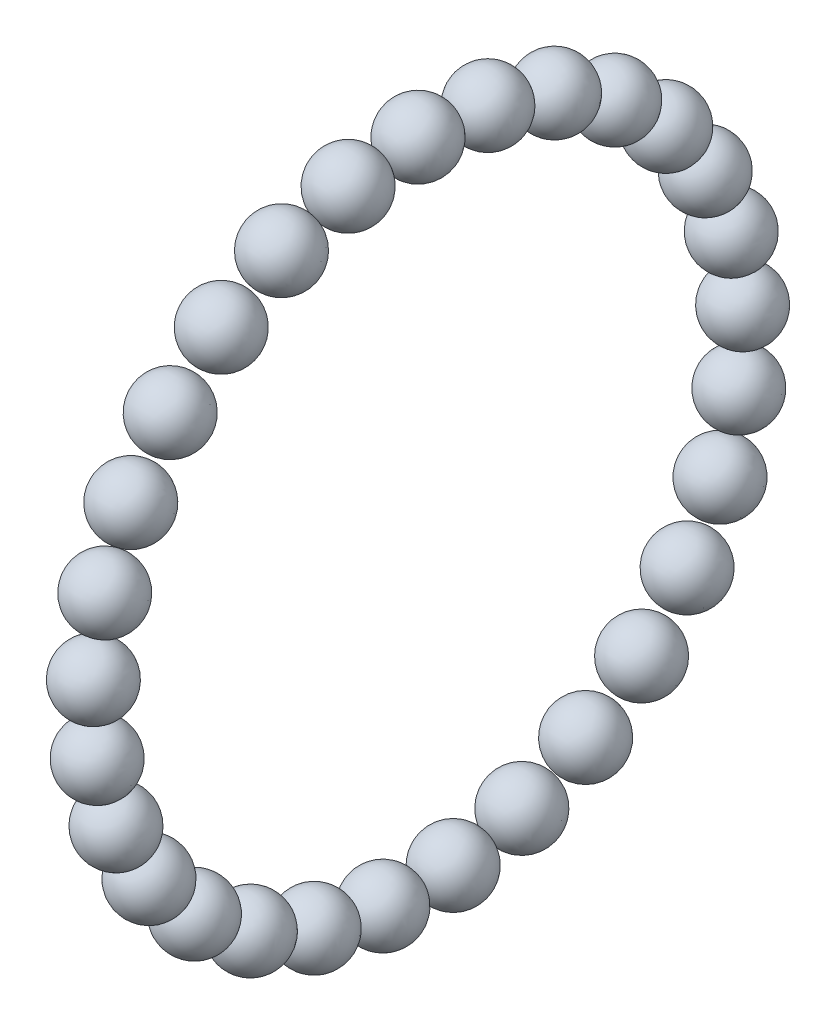
ISO-10303-21;
HEADER;
FILE_DESCRIPTION(('STEP AP214'),'2;1');
FILE_NAME('part.step','',(''),(''),'','','');
FILE_SCHEMA(('AUTOMOTIVE_DESIGN { 1 0 10303 214 1 1 1 1 }'));
ENDSEC;
DATA;
#1=APPLICATION_CONTEXT('core data for automotive mechanical design processes');
#2=APPLICATION_PROTOCOL_DEFINITION('international standard','automotive_design',2000,#1);
#3=PRODUCT_CONTEXT('',#1,'mechanical');
#4=PRODUCT('Part','Part','',(#3));
#5=PRODUCT_RELATED_PRODUCT_CATEGORY('part','',(#4));
#6=PRODUCT_DEFINITION_FORMATION('','',#4);
#7=PRODUCT_DEFINITION_CONTEXT('part definition',#1,'design');
#8=PRODUCT_DEFINITION('design','',#6,#7);
#9=PRODUCT_DEFINITION_SHAPE('','',#8);
#10=(LENGTH_UNIT() NAMED_UNIT(*) SI_UNIT(.MILLI.,.METRE.));
#11=(NAMED_UNIT(*) PLANE_ANGLE_UNIT() SI_UNIT($,.RADIAN.));
#12=(NAMED_UNIT(*) SI_UNIT($,.STERADIAN.) SOLID_ANGLE_UNIT());
#13=UNCERTAINTY_MEASURE_WITH_UNIT(LENGTH_MEASURE(1.E-05),#10,'distance_accuracy_value','');
#14=(GEOMETRIC_REPRESENTATION_CONTEXT(3) GLOBAL_UNCERTAINTY_ASSIGNED_CONTEXT((#13)) GLOBAL_UNIT_ASSIGNED_CONTEXT((#10,
#11,#12)) REPRESENTATION_CONTEXT('',''));
#15=CARTESIAN_POINT('',(0.,0.,0.));
#16=DIRECTION('',(0.,0.,1.));
#17=DIRECTION('',(1.,0.,0.));
#18=AXIS2_PLACEMENT_3D('',#15,#16,#17);
#19=CARTESIAN_POINT('',(0.,18.6052961032546,-8.60772658198543));
#20=DIRECTION('',(0.,0.419889101560265,0.907575419670957));
#21=DIRECTION('',(1.,0.,0.));
#22=AXIS2_PLACEMENT_3D('',#19,#20,#21);
#23=SPHERICAL_SURFACE('',#22,2.1);
#24=CARTESIAN_POINT('',(0.,19.4870632165312,-6.70181820067642));
#25=VERTEX_POINT('',#24);
#26=VERTEX_LOOP('',#25);
#27=FACE_BOUND('',#26,.T.);
#28=ADVANCED_FACE('F12',(#27),#23,.T.);
#29=CLOSED_SHELL('',(#28));
#30=MANIFOLD_SOLID_BREP('B1',#29);
#31=CARTESIAN_POINT('',(0.,13.2714188380275,-15.6243221301166));
#32=DIRECTION('',(0.,0.762162055127636,0.647386284781828));
#33=DIRECTION('',(1.,0.,0.));
#34=AXIS2_PLACEMENT_3D('',#31,#32,#33);
#35=SPHERICAL_SURFACE('',#34,2.1);
#36=CARTESIAN_POINT('',(0.,14.8719591537955,-14.2648109320747));
#37=VERTEX_POINT('',#36);
#38=VERTEX_LOOP('',#37);
#39=FACE_BOUND('',#38,.T.);
#40=ADVANCED_FACE('F20',(#39),#35,.T.);
#41=CLOSED_SHELL('',(#40));
#42=MANIFOLD_SOLID_BREP('B1',#41);
#43=CARTESIAN_POINT('',(0.,5.48433093984903,-19.7527748466441));
#44=DIRECTION('',(0.,0.963549992519223,0.267528338529221));
#45=DIRECTION('',(1.,0.,0.));
#46=AXIS2_PLACEMENT_3D('',#43,#44,#45);
#47=SPHERICAL_SURFACE('',#46,2.1);
#48=CARTESIAN_POINT('',(0.,7.5077859241394,-19.1909653357327));
#49=VERTEX_POINT('',#48);
#50=VERTEX_LOOP('',#49);
#51=FACE_BOUND('',#50,.T.);
#52=ADVANCED_FACE('F30',(#51),#47,.T.);
#53=CLOSED_SHELL('',(#52));
#54=MANIFOLD_SOLID_BREP('B1',#53);
#55=CARTESIAN_POINT('',(0.,-3.31653092933168,-20.2299437121013));
#56=DIRECTION('',(0.,0.986826522541526,-0.161781996552765));
#57=DIRECTION('',(1.,0.,0.));
#58=AXIS2_PLACEMENT_3D('',#55,#56,#57);
#59=SPHERICAL_SURFACE('',#58,2.1);
#60=CARTESIAN_POINT('',(0.,-1.24419523199448,-20.5696859048621));
#61=VERTEX_POINT('',#60);
#62=VERTEX_LOOP('',#61);
#63=FACE_BOUND('',#62,.T.);
#64=ADVANCED_FACE('F34',(#63),#59,.T.);
#65=CLOSED_SHELL('',(#64));
#66=MANIFOLD_SOLID_BREP('B1',#65);
#67=CARTESIAN_POINT('',(0.,-11.5043348399288,-16.9676244622163));
#68=DIRECTION('',(0.,0.827688998156891,-0.561187065362383));
#69=DIRECTION('',(1.,0.,0.));
#70=AXIS2_PLACEMENT_3D('',#67,#68,#69);
#71=SPHERICAL_SURFACE('',#70,2.1);
#72=CARTESIAN_POINT('',(0.,-9.76618794379937,-18.1461172994773));
#73=VERTEX_POINT('',#72);
#74=VERTEX_LOOP('',#73);
#75=FACE_BOUND('',#74,.T.);
#76=ADVANCED_FACE('F39',(#75),#71,.T.);
#77=CLOSED_SHELL('',(#76));
#78=MANIFOLD_SOLID_BREP('B1',#77);
#79=CARTESIAN_POINT('',(0.,-17.5655721114356,-10.5688540721289));
#80=DIRECTION('',(0.,0.515553857177022,-0.856857176167589));
#81=DIRECTION('',(1.,0.,0.));
#82=AXIS2_PLACEMENT_3D('',#79,#80,#81);
#83=SPHERICAL_SURFACE('',#82,2.1);
#84=CARTESIAN_POINT('',(0.,-16.4829090113639,-12.3682541420809));
#85=VERTEX_POINT('',#84);
#86=VERTEX_LOOP('',#85);
#87=FACE_BOUND('',#86,.T.);
#88=ADVANCED_FACE('F44',(#87),#83,.T.);
#89=CLOSED_SHELL('',(#88));
#90=MANIFOLD_SOLID_BREP('B1',#89);
#91=CARTESIAN_POINT('',(0.,-20.3798281216643,-2.21643987769081));
#92=DIRECTION('',(0.,0.108119018423942,-0.99413795715436));
#93=DIRECTION('',(1.,0.,0.));
#94=AXIS2_PLACEMENT_3D('',#91,#92,#93);
#95=SPHERICAL_SURFACE('',#94,2.1);
#96=CARTESIAN_POINT('',(0.,-20.1527781829741,-4.30412958771496));
#97=VERTEX_POINT('',#96);
#98=VERTEX_LOOP('',#97);
#99=FACE_BOUND('',#98,.T.);
#100=ADVANCED_FACE('F49',(#99),#95,.T.);
#101=CLOSED_SHELL('',(#100));
#102=MANIFOLD_SOLID_BREP('B1',#101);
#103=CARTESIAN_POINT('',(0.,-19.4268900092474,6.54568136778758));
#104=DIRECTION('',(0.,-0.31930153013598,-0.947653171182803));
#105=DIRECTION('',(1.,0.,0.));
#106=AXIS2_PLACEMENT_3D('',#103,#104,#105);
#107=SPHERICAL_SURFACE('',#106,2.1);
#108=CARTESIAN_POINT('',(0.,-20.097423222533,4.55560970830369));
#109=VERTEX_POINT('',#108);
#110=VERTEX_LOOP('',#109);
#111=FACE_BOUND('',#110,.T.);
#112=ADVANCED_FACE('F54',(#111),#107,.T.);
#113=CLOSED_SHELL('',(#112));
#114=MANIFOLD_SOLID_BREP('B1',#113);
#115=CARTESIAN_POINT('',(0.,-14.8829075844242,14.0978389064952));
#116=DIRECTION('',(0.,-0.687699458853423,-0.725995491923131));
#117=DIRECTION('',(1.,0.,0.));
#118=AXIS2_PLACEMENT_3D('',#115,#116,#117);
#119=SPHERICAL_SURFACE('',#118,2.1);
#120=CARTESIAN_POINT('',(0.,-16.3270764480164,12.5732483734566));
#121=VERTEX_POINT('',#120);
#122=VERTEX_LOOP('',#121);
#123=FACE_BOUND('',#122,.T.);
#124=ADVANCED_FACE('F59',(#123),#119,.T.);
#125=CLOSED_SHELL('',(#124));
#126=MANIFOLD_SOLID_BREP('B1',#125);
#127=CARTESIAN_POINT('',(0.,-7.58783218446825,19.0440227562442));
#128=DIRECTION('',(0.,-0.928976719816791,-0.370138155339915));
#129=DIRECTION('',(1.,0.,0.));
#130=AXIS2_PLACEMENT_3D('',#127,#128,#129);
#131=SPHERICAL_SURFACE('',#130,2.1);
#132=CARTESIAN_POINT('',(0.,-9.53868329608351,18.2667326300304));
#133=VERTEX_POINT('',#132);
#134=VERTEX_LOOP('',#133);
#135=FACE_BOUND('',#134,.T.);
#136=ADVANCED_FACE('F64',(#135),#131,.T.);
#137=CLOSED_SHELL('',(#136));
#138=MANIFOLD_SOLID_BREP('B1',#137);
#139=CARTESIAN_POINT('',(0.,1.10984762600106,20.4699349839481));
#140=DIRECTION('',(0.,-0.998533413851124,0.0541389085854176));
#141=DIRECTION('',(1.,0.,0.));
#142=AXIS2_PLACEMENT_3D('',#139,#140,#141);
#143=SPHERICAL_SURFACE('',#142,2.1);
#144=CARTESIAN_POINT('',(0.,-0.9870725430863,20.5836266919774));
#145=VERTEX_POINT('',#144);
#146=VERTEX_LOOP('',#145);
#147=FACE_BOUND('',#146,.T.);
#148=ADVANCED_FACE('F69',(#147),#143,.T.);
#149=CLOSED_SHELL('',(#148));
#150=MANIFOLD_SOLID_BREP('B1',#149);
#151=CARTESIAN_POINT('',(0.,9.6023730343457,18.1119969111435));
#152=DIRECTION('',(0.,-0.883512044446023,0.46840844069979));
#153=DIRECTION('',(1.,0.,0.));
#154=AXIS2_PLACEMENT_3D('',#151,#152,#153);
#155=SPHERICAL_SURFACE('',#154,2.1);
#156=CARTESIAN_POINT('',(0.,7.74699774100905,19.095654636613));
#157=VERTEX_POINT('',#156);
#158=VERTEX_LOOP('',#157);
#159=FACE_BOUND('',#158,.T.);
#160=ADVANCED_FACE('F74',(#159),#155,.T.);
#161=CLOSED_SHELL('',(#160));
#162=MANIFOLD_SOLID_BREP('B1',#161);
#163=CARTESIAN_POINT('',(0.,16.3199078469657,12.4060714114722));
#164=DIRECTION('',(0.,-0.605174215193765,0.796093065705644));
#165=DIRECTION('',(1.,0.,0.));
#166=AXIS2_PLACEMENT_3D('',#163,#164,#165);
#167=SPHERICAL_SURFACE('',#166,2.1);
#168=CARTESIAN_POINT('',(0.,15.0490419950588,14.0778668494541));
#169=VERTEX_POINT('',#168);
#170=VERTEX_LOOP('',#169);
#171=FACE_BOUND('',#170,.T.);
#172=ADVANCED_FACE('F79',(#171),#167,.T.);
#173=CLOSED_SHELL('',(#172));
#174=MANIFOLD_SOLID_BREP('B1',#173);
#175=CARTESIAN_POINT('',(0.,20.0207213920568,4.40689402432599));
#176=DIRECTION('',(0.,-0.214970440211024,0.976620555710087));
#177=DIRECTION('',(1.,0.,0.));
#178=AXIS2_PLACEMENT_3D('',#175,#176,#177);
#179=SPHERICAL_SURFACE('',#178,2.1);
#180=CARTESIAN_POINT('',(0.,19.5692834676136,6.45779719131718));
#181=VERTEX_POINT('',#180);
#182=VERTEX_LOOP('',#181);
#183=FACE_BOUND('',#182,.T.);
#184=ADVANCED_FACE('F84',(#183),#179,.T.);
#185=CLOSED_SHELL('',(#184));
#186=MANIFOLD_SOLID_BREP('B1',#185);
#187=CARTESIAN_POINT('',(0.,0.,0.));
#188=DIRECTION('',(0.,0.,1.));
#189=DIRECTION('',(1.,0.,0.));
#190=AXIS2_PLACEMENT_3D('',#187,#188,#189);
#191=SPHERICAL_SURFACE('',#190,0.005);
#192=CARTESIAN_POINT('',(0.,0.,0.005));
#193=VERTEX_POINT('',#192);
#194=VERTEX_LOOP('',#193);
#195=FACE_BOUND('',#194,.T.);
#196=ADVANCED_FACE('F89',(#195),#191,.T.);
#197=CLOSED_SHELL('',(#196));
#198=MANIFOLD_SOLID_BREP('B1',#197);
#199=CARTESIAN_POINT('',(0.,20.5,0.));
#200=DIRECTION('',(0.,0.,1.));
#201=DIRECTION('',(1.,0.,0.));
#202=AXIS2_PLACEMENT_3D('',#199,#200,#201);
#203=SPHERICAL_SURFACE('',#202,2.1);
#204=CARTESIAN_POINT('',(0.,20.5,2.1));
#205=VERTEX_POINT('',#204);
#206=VERTEX_LOOP('',#205);
#207=FACE_BOUND('',#206,.T.);
#208=ADVANCED_FACE('F94',(#207),#203,.T.);
#209=CLOSED_SHELL('',(#208));
#210=MANIFOLD_SOLID_BREP('B1',#209);
#211=CARTESIAN_POINT('',(0.,18.6052961032546,8.60772658198543));
#212=DIRECTION('',(0.,-0.419889101560264,0.907575419670957));
#213=DIRECTION('',(1.,0.,0.));
#214=AXIS2_PLACEMENT_3D('',#211,#212,#213);
#215=SPHERICAL_SURFACE('',#214,2.1);
#216=CARTESIAN_POINT('',(0.,17.723528989978,10.5136349632944));
#217=VERTEX_POINT('',#216);
#218=VERTEX_LOOP('',#217);
#219=FACE_BOUND('',#218,.T.);
#220=ADVANCED_FACE('F99',(#219),#215,.T.);
#221=CLOSED_SHELL('',(#220));
#222=MANIFOLD_SOLID_BREP('B1',#221);
#223=CARTESIAN_POINT('',(0.,13.2714188380275,15.6243221301166));
#224=DIRECTION('',(0.,-0.762162055127637,0.647386284781828));
#225=DIRECTION('',(1.,0.,0.));
#226=AXIS2_PLACEMENT_3D('',#223,#224,#225);
#227=SPHERICAL_SURFACE('',#226,2.1);
#228=CARTESIAN_POINT('',(0.,11.6708785222594,16.9838333281584));
#229=VERTEX_POINT('',#228);
#230=VERTEX_LOOP('',#229);
#231=FACE_BOUND('',#230,.T.);
#232=ADVANCED_FACE('F104',(#231),#227,.T.);
#233=CLOSED_SHELL('',(#232));
#234=MANIFOLD_SOLID_BREP('B1',#233);
#235=CARTESIAN_POINT('',(0.,5.48433093984903,19.7527748466441));
#236=DIRECTION('',(0.,-0.963549992519223,0.267528338529221));
#237=DIRECTION('',(1.,0.,0.));
#238=AXIS2_PLACEMENT_3D('',#235,#236,#237);
#239=SPHERICAL_SURFACE('',#238,2.1);
#240=CARTESIAN_POINT('',(0.,3.46087595555866,20.3145843575554));
#241=VERTEX_POINT('',#240);
#242=VERTEX_LOOP('',#241);
#243=FACE_BOUND('',#242,.T.);
#244=ADVANCED_FACE('F109',(#243),#239,.T.);
#245=CLOSED_SHELL('',(#244));
#246=MANIFOLD_SOLID_BREP('B1',#245);
#247=CARTESIAN_POINT('',(0.,-3.31653092933168,20.2299437121013));
#248=DIRECTION('',(0.,-0.986826522541526,-0.161781996552764));
#249=DIRECTION('',(1.,0.,0.));
#250=AXIS2_PLACEMENT_3D('',#247,#248,#249);
#251=SPHERICAL_SURFACE('',#250,2.1);
#252=CARTESIAN_POINT('',(0.,-5.38886662666888,19.8902015193405));
#253=VERTEX_POINT('',#252);
#254=VERTEX_LOOP('',#253);
#255=FACE_BOUND('',#254,.T.);
#256=ADVANCED_FACE('F114',(#255),#251,.T.);
#257=CLOSED_SHELL('',(#256));
#258=MANIFOLD_SOLID_BREP('B1',#257);
#259=CARTESIAN_POINT('',(0.,-11.5043348399288,16.9676244622163));
#260=DIRECTION('',(0.,-0.827688998156891,-0.561187065362382));
#261=DIRECTION('',(1.,0.,0.));
#262=AXIS2_PLACEMENT_3D('',#259,#260,#261);
#263=SPHERICAL_SURFACE('',#262,2.1);
#264=CARTESIAN_POINT('',(0.,-13.2424817360583,15.7891316249552));
#265=VERTEX_POINT('',#264);
#266=VERTEX_LOOP('',#265);
#267=FACE_BOUND('',#266,.T.);
#268=ADVANCED_FACE('F119',(#267),#263,.T.);
#269=CLOSED_SHELL('',(#268));
#270=MANIFOLD_SOLID_BREP('B1',#269);
#271=CARTESIAN_POINT('',(0.,-17.5655721114356,10.5688540721289));
#272=DIRECTION('',(0.,-0.515553857177022,-0.856857176167589));
#273=DIRECTION('',(1.,0.,0.));
#274=AXIS2_PLACEMENT_3D('',#271,#272,#273);
#275=SPHERICAL_SURFACE('',#274,2.1);
#276=CARTESIAN_POINT('',(0.,-18.6482352115073,8.769454002177));
#277=VERTEX_POINT('',#276);
#278=VERTEX_LOOP('',#277);
#279=FACE_BOUND('',#278,.T.);
#280=ADVANCED_FACE('F124',(#279),#275,.T.);
#281=CLOSED_SHELL('',(#280));
#282=MANIFOLD_SOLID_BREP('B1',#281);
#283=CARTESIAN_POINT('',(0.,-20.3798281216643,2.21643987769081));
#284=DIRECTION('',(0.,-0.108119018423942,-0.99413795715436));
#285=DIRECTION('',(1.,0.,0.));
#286=AXIS2_PLACEMENT_3D('',#283,#284,#285);
#287=SPHERICAL_SURFACE('',#286,2.1);
#288=CARTESIAN_POINT('',(0.,-20.6068780603546,0.128750167666654));
#289=VERTEX_POINT('',#288);
#290=VERTEX_LOOP('',#289);
#291=FACE_BOUND('',#290,.T.);
#292=ADVANCED_FACE('F129',(#291),#287,.T.);
#293=CLOSED_SHELL('',(#292));
#294=MANIFOLD_SOLID_BREP('B1',#293);
#295=CARTESIAN_POINT('',(0.,-19.4268900092474,-6.54568136778759));
#296=DIRECTION('',(0.,0.31930153013598,-0.947653171182802));
#297=DIRECTION('',(1.,0.,0.));
#298=AXIS2_PLACEMENT_3D('',#295,#296,#297);
#299=SPHERICAL_SURFACE('',#298,2.1);
#300=CARTESIAN_POINT('',(0.,-18.7563567959619,-8.53575302727147));
#301=VERTEX_POINT('',#300);
#302=VERTEX_LOOP('',#301);
#303=FACE_BOUND('',#302,.T.);
#304=ADVANCED_FACE('F134',(#303),#299,.T.);
#305=CLOSED_SHELL('',(#304));
#306=MANIFOLD_SOLID_BREP('B1',#305);
#307=CARTESIAN_POINT('',(0.,-14.8829075844242,-14.0978389064952));
#308=DIRECTION('',(0.,0.687699458853423,-0.725995491923131));
#309=DIRECTION('',(1.,0.,0.));
#310=AXIS2_PLACEMENT_3D('',#307,#308,#309);
#311=SPHERICAL_SURFACE('',#310,2.1);
#312=CARTESIAN_POINT('',(0.,-13.438738720832,-15.6224294395338));
#313=VERTEX_POINT('',#312);
#314=VERTEX_LOOP('',#313);
#315=FACE_BOUND('',#314,.T.);
#316=ADVANCED_FACE('F139',(#315),#311,.T.);
#317=CLOSED_SHELL('',(#316));
#318=MANIFOLD_SOLID_BREP('B1',#317);
#319=CARTESIAN_POINT('',(0.,-7.58783218446825,-19.0440227562442));
#320=DIRECTION('',(0.,0.928976719816791,-0.370138155339915));
#321=DIRECTION('',(1.,0.,0.));
#322=AXIS2_PLACEMENT_3D('',#319,#320,#321);
#323=SPHERICAL_SURFACE('',#322,2.1);
#324=CARTESIAN_POINT('',(0.,-5.63698107285299,-19.821312882458));
#325=VERTEX_POINT('',#324);
#326=VERTEX_LOOP('',#325);
#327=FACE_BOUND('',#326,.T.);
#328=ADVANCED_FACE('F144',(#327),#323,.T.);
#329=CLOSED_SHELL('',(#328));
#330=MANIFOLD_SOLID_BREP('B1',#329);
#331=CARTESIAN_POINT('',(0.,1.10984762600106,-20.4699349839481));
#332=DIRECTION('',(0.,0.998533413851124,0.0541389085854176));
#333=DIRECTION('',(1.,0.,0.));
#334=AXIS2_PLACEMENT_3D('',#331,#332,#333);
#335=SPHERICAL_SURFACE('',#334,2.1);
#336=CARTESIAN_POINT('',(0.,3.20676779508842,-20.3562432759187));
#337=VERTEX_POINT('',#336);
#338=VERTEX_LOOP('',#337);
#339=FACE_BOUND('',#338,.T.);
#340=ADVANCED_FACE('F149',(#339),#335,.T.);
#341=CLOSED_SHELL('',(#340));
#342=MANIFOLD_SOLID_BREP('B1',#341);
#343=CARTESIAN_POINT('',(0.,9.6023730343457,-18.1119969111435));
#344=DIRECTION('',(0.,0.883512044446023,0.46840844069979));
#345=DIRECTION('',(1.,0.,0.));
#346=AXIS2_PLACEMENT_3D('',#343,#344,#345);
#347=SPHERICAL_SURFACE('',#346,2.1);
#348=CARTESIAN_POINT('',(0.,11.4577483276823,-17.1283391856739));
#349=VERTEX_POINT('',#348);
#350=VERTEX_LOOP('',#349);
#351=FACE_BOUND('',#350,.T.);
#352=ADVANCED_FACE('F154',(#351),#347,.T.);
#353=CLOSED_SHELL('',(#352));
#354=MANIFOLD_SOLID_BREP('B1',#353);
#355=CARTESIAN_POINT('',(0.,16.3199078469657,-12.4060714114722));
#356=DIRECTION('',(0.,0.605174215193765,0.796093065705644));
#357=DIRECTION('',(1.,0.,0.));
#358=AXIS2_PLACEMENT_3D('',#355,#356,#357);
#359=SPHERICAL_SURFACE('',#358,2.1);
#360=CARTESIAN_POINT('',(0.,17.5907736988726,-10.7342759734903));
#361=VERTEX_POINT('',#360);
#362=VERTEX_LOOP('',#361);
#363=FACE_BOUND('',#362,.T.);
#364=ADVANCED_FACE('F158',(#363),#359,.T.);
#365=CLOSED_SHELL('',(#364));
#366=MANIFOLD_SOLID_BREP('B1',#365);
#367=CARTESIAN_POINT('',(0.,20.0207213920568,-4.406894024326));
#368=DIRECTION('',(0.,0.214970440211025,0.976620555710087));
#369=DIRECTION('',(1.,0.,0.));
#370=AXIS2_PLACEMENT_3D('',#367,#368,#369);
#371=SPHERICAL_SURFACE('',#370,2.1);
#372=CARTESIAN_POINT('',(0.,20.4721593165,-2.35599085733482));
#373=VERTEX_POINT('',#372);
#374=VERTEX_LOOP('',#373);
#375=FACE_BOUND('',#374,.T.);
#376=ADVANCED_FACE('F14',(#375),#371,.T.);
#377=CLOSED_SHELL('',(#376));
#378=MANIFOLD_SOLID_BREP('B1',#377);
#379=ADVANCED_BREP_SHAPE_REPRESENTATION('',(#18,#30,#42,#54,#66,#78,#90,#102,#114,#126,#138,
#150,#162,#174,#186,#198,#210,#222,#234,#246,#258,#270,#282,#294,#306,#318,#330,#342,#354,#366,
#378),#14);
#380=SHAPE_DEFINITION_REPRESENTATION(#9,#379);
ENDSEC;
END-ISO-10303-21;
